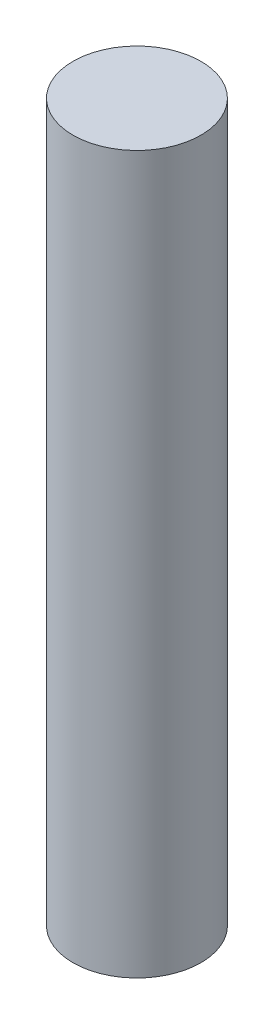
ISO-10303-21;
HEADER;
FILE_DESCRIPTION(('STEP AP214'),'2;1');
FILE_NAME('part.step','',(''),(''),'','','');
FILE_SCHEMA(('AUTOMOTIVE_DESIGN { 1 0 10303 214 1 1 1 1 }'));
ENDSEC;
DATA;
#1=APPLICATION_CONTEXT('core data for automotive mechanical design processes');
#2=APPLICATION_PROTOCOL_DEFINITION('international standard','automotive_design',2000,#1);
#3=PRODUCT_CONTEXT('',#1,'mechanical');
#4=PRODUCT('Part','Part','',(#3));
#5=PRODUCT_RELATED_PRODUCT_CATEGORY('part','',(#4));
#6=PRODUCT_DEFINITION_FORMATION('','',#4);
#7=PRODUCT_DEFINITION_CONTEXT('part definition',#1,'design');
#8=PRODUCT_DEFINITION('design','',#6,#7);
#9=PRODUCT_DEFINITION_SHAPE('','',#8);
#10=(LENGTH_UNIT() NAMED_UNIT(*) SI_UNIT(.MILLI.,.METRE.));
#11=(NAMED_UNIT(*) PLANE_ANGLE_UNIT() SI_UNIT($,.RADIAN.));
#12=(NAMED_UNIT(*) SI_UNIT($,.STERADIAN.) SOLID_ANGLE_UNIT());
#13=UNCERTAINTY_MEASURE_WITH_UNIT(LENGTH_MEASURE(1.E-05),#10,'distance_accuracy_value','');
#14=(GEOMETRIC_REPRESENTATION_CONTEXT(3) GLOBAL_UNCERTAINTY_ASSIGNED_CONTEXT((#13)) GLOBAL_UNIT_ASSIGNED_CONTEXT((#10,
#11,#12)) REPRESENTATION_CONTEXT('',''));
#15=CARTESIAN_POINT('',(0.,0.,0.));
#16=DIRECTION('',(0.,0.,1.));
#17=DIRECTION('',(1.,0.,0.));
#18=AXIS2_PLACEMENT_3D('',#15,#16,#17);
#19=CARTESIAN_POINT('',(0.,140.,0.));
#20=DIRECTION('',(0.,-1.,0.));
#21=DIRECTION('',(0.,0.,-1.));
#22=AXIS2_PLACEMENT_3D('',#19,#20,#21);
#23=CYLINDRICAL_SURFACE('',#22,12.5);
#24=CARTESIAN_POINT('',(0.,140.,0.));
#25=DIRECTION('',(0.,1.,0.));
#26=DIRECTION('',(0.,0.,1.));
#27=AXIS2_PLACEMENT_3D('',#24,#25,#26);
#28=CIRCLE('',#27,12.5);
#29=CARTESIAN_POINT('',(0.,140.,12.5));
#30=VERTEX_POINT('',#29);
#31=EDGE_CURVE('E10',#30,#30,#28,.T.);
#32=ORIENTED_EDGE('',*,*,#31,.F.);
#33=EDGE_LOOP('',(#32));
#34=FACE_BOUND('',#33,.T.);
#35=CARTESIAN_POINT('',(0.,0.,0.));
#36=DIRECTION('',(0.,1.,0.));
#37=DIRECTION('',(0.,0.,1.));
#38=AXIS2_PLACEMENT_3D('',#35,#36,#37);
#39=CIRCLE('',#38,12.5);
#40=CARTESIAN_POINT('',(0.,0.,12.5));
#41=VERTEX_POINT('',#40);
#42=EDGE_CURVE('E40',#41,#41,#39,.T.);
#43=ORIENTED_EDGE('',*,*,#42,.T.);
#44=EDGE_LOOP('',(#43));
#45=FACE_BOUND('',#44,.T.);
#46=ADVANCED_FACE('F37',(#34,#45),#23,.T.);
#47=CARTESIAN_POINT('',(0.,140.,0.));
#48=DIRECTION('',(0.,1.,0.));
#49=DIRECTION('',(0.,0.,1.));
#50=AXIS2_PLACEMENT_3D('',#47,#48,#49);
#51=PLANE('',#50);
#52=ORIENTED_EDGE('',*,*,#31,.T.);
#53=EDGE_LOOP('',(#52));
#54=FACE_BOUND('',#53,.T.);
#55=ADVANCED_FACE('F54',(#54),#51,.T.);
#56=CARTESIAN_POINT('',(0.,0.,0.));
#57=DIRECTION('',(0.,1.,0.));
#58=DIRECTION('',(0.,0.,1.));
#59=AXIS2_PLACEMENT_3D('',#56,#57,#58);
#60=PLANE('',#59);
#61=ORIENTED_EDGE('',*,*,#42,.F.);
#62=EDGE_LOOP('',(#61));
#63=FACE_BOUND('',#62,.T.);
#64=ADVANCED_FACE('F52',(#63),#60,.F.);
#65=CLOSED_SHELL('',(#46,#55,#64));
#66=MANIFOLD_SOLID_BREP('B2',#65);
#67=ADVANCED_BREP_SHAPE_REPRESENTATION('',(#18,#66),#14);
#68=SHAPE_DEFINITION_REPRESENTATION(#9,#67);
ENDSEC;
END-ISO-10303-21;
